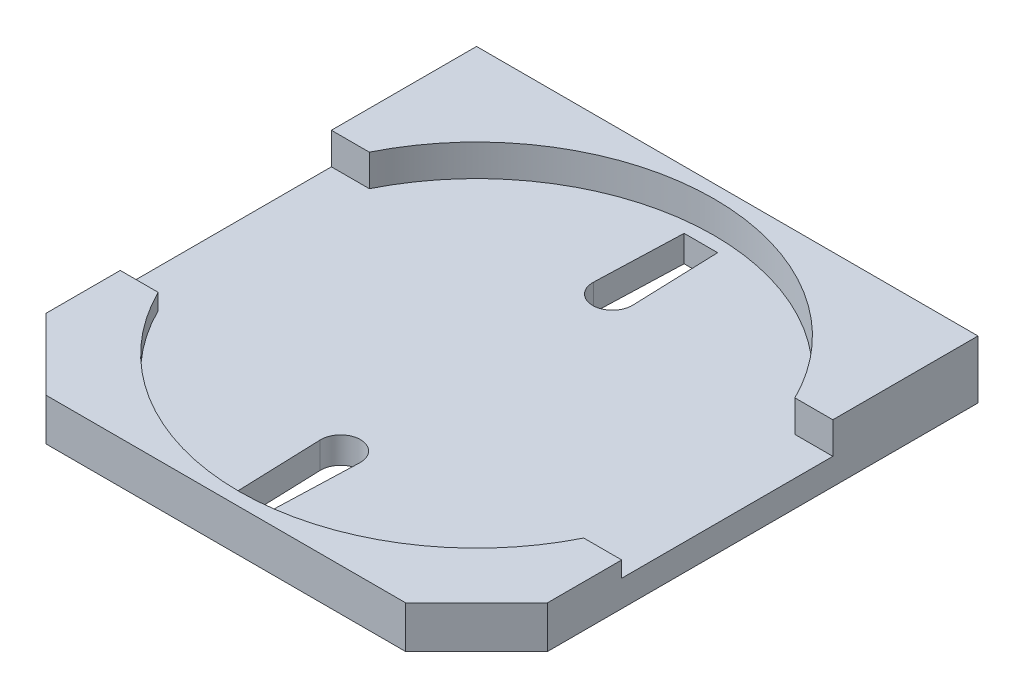
ISO-10303-21;
HEADER;
FILE_DESCRIPTION(('STEP AP214'),'2;1');
FILE_NAME('part.step','',(''),(''),'','','');
FILE_SCHEMA(('AUTOMOTIVE_DESIGN { 1 0 10303 214 1 1 1 1 }'));
ENDSEC;
DATA;
#1=APPLICATION_CONTEXT('core data for automotive mechanical design processes');
#2=APPLICATION_PROTOCOL_DEFINITION('international standard','automotive_design',2000,#1);
#3=PRODUCT_CONTEXT('',#1,'mechanical');
#4=PRODUCT('Part','Part','',(#3));
#5=PRODUCT_RELATED_PRODUCT_CATEGORY('part','',(#4));
#6=PRODUCT_DEFINITION_FORMATION('','',#4);
#7=PRODUCT_DEFINITION_CONTEXT('part definition',#1,'design');
#8=PRODUCT_DEFINITION('design','',#6,#7);
#9=PRODUCT_DEFINITION_SHAPE('','',#8);
#10=(LENGTH_UNIT() NAMED_UNIT(*) SI_UNIT(.MILLI.,.METRE.));
#11=(NAMED_UNIT(*) PLANE_ANGLE_UNIT() SI_UNIT($,.RADIAN.));
#12=(NAMED_UNIT(*) SI_UNIT($,.STERADIAN.) SOLID_ANGLE_UNIT());
#13=UNCERTAINTY_MEASURE_WITH_UNIT(LENGTH_MEASURE(1.E-05),#10,'distance_accuracy_value','');
#14=(GEOMETRIC_REPRESENTATION_CONTEXT(3) GLOBAL_UNCERTAINTY_ASSIGNED_CONTEXT((#13)) GLOBAL_UNIT_ASSIGNED_CONTEXT((#10,
#11,#12)) REPRESENTATION_CONTEXT('',''));
#15=CARTESIAN_POINT('',(0.,0.,0.));
#16=DIRECTION('',(0.,0.,1.));
#17=DIRECTION('',(1.,0.,0.));
#18=AXIS2_PLACEMENT_3D('',#15,#16,#17);
#19=CARTESIAN_POINT('',(-0.6,2.3,9.49999999999999));
#20=DIRECTION('',(0.999402445633192,0.,-0.0345651799126632));
#21=DIRECTION('',(-0.0345651799126632,0.,-0.999402445633192));
#22=AXIS2_PLACEMENT_3D('',#19,#20,#21);
#23=PLANE('',#22);
#24=DIRECTION('',(0.0345651799126632,0.,0.999402445633192));
#25=VECTOR('',#24,1.);
#26=CARTESIAN_POINT('',(-0.6,2.3,9.49999999999999));
#27=LINE('',#26,#25);
#28=CARTESIAN_POINT('',(-0.749551834224894,2.3,5.17592388493449));
#29=VERTEX_POINT('',#28);
#30=CARTESIAN_POINT('',(-0.63458584683647,2.3,8.49999999999999));
#31=VERTEX_POINT('',#30);
#32=EDGE_CURVE('E192',#29,#31,#27,.T.);
#33=ORIENTED_EDGE('',*,*,#32,.T.);
#34=DIRECTION('',(0.,-1.,0.));
#35=VECTOR('',#34,1.);
#36=CARTESIAN_POINT('',(-0.63458584683647,2.3,8.49999999999999));
#37=LINE('',#36,#35);
#38=CARTESIAN_POINT('',(-0.63458584683647,1.3,8.49999999999999));
#39=VERTEX_POINT('',#38);
#40=EDGE_CURVE('E196',#31,#39,#37,.T.);
#41=ORIENTED_EDGE('',*,*,#40,.T.);
#42=DIRECTION('',(0.0345651799126632,0.,0.999402445633192));
#43=VECTOR('',#42,1.);
#44=CARTESIAN_POINT('',(-0.6,1.3,9.49999999999999));
#45=LINE('',#44,#43);
#46=CARTESIAN_POINT('',(-0.749551834224894,1.3,5.17592388493449));
#47=VERTEX_POINT('',#46);
#48=EDGE_CURVE('E217',#47,#39,#45,.T.);
#49=ORIENTED_EDGE('',*,*,#48,.F.);
#50=DIRECTION('',(0.,-1.,0.));
#51=VECTOR('',#50,1.);
#52=CARTESIAN_POINT('',(-0.749551834224894,2.3,5.17592388493449));
#53=LINE('',#52,#51);
#54=EDGE_CURVE('E205',#29,#47,#53,.T.);
#55=ORIENTED_EDGE('',*,*,#54,.F.);
#56=EDGE_LOOP('',(#33,#41,#49,#55));
#57=FACE_BOUND('',#56,.T.);
#58=ADVANCED_FACE('F36',(#57),#23,.T.);
#59=CARTESIAN_POINT('',(0.6,2.3,9.49999999999999));
#60=DIRECTION('',(-0.999402445633192,0.,-0.0345651799126632));
#61=DIRECTION('',(-0.0345651799126632,0.,0.999402445633192));
#62=AXIS2_PLACEMENT_3D('',#59,#60,#61);
#63=PLANE('',#62);
#64=DIRECTION('',(0.0345651799126632,0.,-0.999402445633192));
#65=VECTOR('',#64,1.);
#66=CARTESIAN_POINT('',(0.6,1.3,9.49999999999999));
#67=LINE('',#66,#65);
#68=CARTESIAN_POINT('',(0.63458584683647,1.3,8.49999999999999));
#69=VERTEX_POINT('',#68);
#70=CARTESIAN_POINT('',(0.749551834224894,1.3,5.17592388493449));
#71=VERTEX_POINT('',#70);
#72=EDGE_CURVE('E207',#69,#71,#67,.T.);
#73=ORIENTED_EDGE('',*,*,#72,.F.);
#74=DIRECTION('',(0.,-1.,0.));
#75=VECTOR('',#74,1.);
#76=CARTESIAN_POINT('',(0.63458584683647,2.3,8.49999999999999));
#77=LINE('',#76,#75);
#78=CARTESIAN_POINT('',(0.63458584683647,2.3,8.49999999999999));
#79=VERTEX_POINT('',#78);
#80=EDGE_CURVE('E201',#79,#69,#77,.T.);
#81=ORIENTED_EDGE('',*,*,#80,.F.);
#82=DIRECTION('',(0.0345651799126632,0.,-0.999402445633192));
#83=VECTOR('',#82,1.);
#84=CARTESIAN_POINT('',(0.6,2.3,9.49999999999999));
#85=LINE('',#84,#83);
#86=CARTESIAN_POINT('',(0.749551834224894,2.3,5.17592388493449));
#87=VERTEX_POINT('',#86);
#88=EDGE_CURVE('E193',#79,#87,#85,.T.);
#89=ORIENTED_EDGE('',*,*,#88,.T.);
#90=DIRECTION('',(0.,-1.,0.));
#91=VECTOR('',#90,1.);
#92=CARTESIAN_POINT('',(0.749551834224894,2.3,5.17592388493449));
#93=LINE('',#92,#91);
#94=EDGE_CURVE('E221',#87,#71,#93,.T.);
#95=ORIENTED_EDGE('',*,*,#94,.T.);
#96=EDGE_LOOP('',(#73,#81,#89,#95));
#97=FACE_BOUND('',#96,.T.);
#98=ADVANCED_FACE('F437',(#97),#63,.T.);
#99=CARTESIAN_POINT('',(-9.5,3.5,9.5));
#100=DIRECTION('',(0.,0.,-1.));
#101=DIRECTION('',(-1.,0.,0.));
#102=AXIS2_PLACEMENT_3D('',#99,#100,#101);
#103=PLANE('',#102);
#104=DIRECTION('',(0.,1.,0.));
#105=VECTOR('',#104,1.);
#106=CARTESIAN_POINT('',(-6.81299423149112,0.,9.5));
#107=LINE('',#106,#105);
#108=CARTESIAN_POINT('',(-6.81299423149112,1.3,9.5));
#109=VERTEX_POINT('',#108);
#110=CARTESIAN_POINT('',(-6.81299423149112,2.9,9.5));
#111=VERTEX_POINT('',#110);
#112=EDGE_CURVE('E348',#109,#111,#107,.T.);
#113=ORIENTED_EDGE('',*,*,#112,.F.);
#114=DIRECTION('',(-1.,0.,0.));
#115=VECTOR('',#114,1.);
#116=CARTESIAN_POINT('',(-9.5,1.3,9.5));
#117=LINE('',#116,#115);
#118=CARTESIAN_POINT('',(6.81299423149112,1.3,9.5));
#119=VERTEX_POINT('',#118);
#120=EDGE_CURVE('E266',#119,#109,#117,.T.);
#121=ORIENTED_EDGE('',*,*,#120,.F.);
#122=DIRECTION('',(0.,1.,0.));
#123=VECTOR('',#122,1.);
#124=CARTESIAN_POINT('',(6.81299423149112,0.,9.5));
#125=LINE('',#124,#123);
#126=CARTESIAN_POINT('',(6.81299423149112,2.9,9.5));
#127=VERTEX_POINT('',#126);
#128=EDGE_CURVE('E346',#119,#127,#125,.T.);
#129=ORIENTED_EDGE('',*,*,#128,.T.);
#130=DIRECTION('',(1.,0.,0.));
#131=VECTOR('',#130,1.);
#132=CARTESIAN_POINT('',(6.81299423149112,2.9,9.5));
#133=LINE('',#132,#131);
#134=EDGE_CURVE('E329',#111,#127,#133,.T.);
#135=ORIENTED_EDGE('',*,*,#134,.F.);
#136=EDGE_LOOP('',(#113,#121,#129,#135));
#137=FACE_BOUND('',#136,.T.);
#138=ADVANCED_FACE('F384',(#137),#103,.F.);
#139=CARTESIAN_POINT('',(9.5,3.5,9.5));
#140=DIRECTION('',(-1.,0.,0.));
#141=DIRECTION('',(0.,0.,1.));
#142=AXIS2_PLACEMENT_3D('',#139,#140,#141);
#143=PLANE('',#142);
#144=DIRECTION('',(0.,0.,1.));
#145=VECTOR('',#144,1.);
#146=CARTESIAN_POINT('',(9.5,1.3,9.5));
#147=LINE('',#146,#145);
#148=CARTESIAN_POINT('',(9.5,1.3,-9.49999999999999));
#149=VERTEX_POINT('',#148);
#150=CARTESIAN_POINT('',(9.5,1.3,6.81299423149112));
#151=VERTEX_POINT('',#150);
#152=EDGE_CURVE('E270',#149,#151,#147,.T.);
#153=ORIENTED_EDGE('',*,*,#152,.F.);
#154=DIRECTION('',(0.,-1.,0.));
#155=VECTOR('',#154,1.);
#156=CARTESIAN_POINT('',(9.5,3.5,-9.5));
#157=LINE('',#156,#155);
#158=CARTESIAN_POINT('',(9.5,3.5,-9.5));
#159=VERTEX_POINT('',#158);
#160=EDGE_CURVE('E44',#159,#149,#157,.T.);
#161=ORIENTED_EDGE('',*,*,#160,.F.);
#162=DIRECTION('',(0.,0.,-1.));
#163=VECTOR('',#162,1.);
#164=CARTESIAN_POINT('',(9.5,3.5,9.5));
#165=LINE('',#164,#163);
#166=CARTESIAN_POINT('',(9.5,3.5,-4.));
#167=VERTEX_POINT('',#166);
#168=EDGE_CURVE('E352',#167,#159,#165,.T.);
#169=ORIENTED_EDGE('',*,*,#168,.F.);
#170=DIRECTION('',(0.,1.,0.));
#171=VECTOR('',#170,1.);
#172=CARTESIAN_POINT('',(9.5,2.9,-4.));
#173=LINE('',#172,#171);
#174=CARTESIAN_POINT('',(9.5,2.3,-4.));
#175=VERTEX_POINT('',#174);
#176=EDGE_CURVE('E338',#175,#167,#173,.T.);
#177=ORIENTED_EDGE('',*,*,#176,.F.);
#178=DIRECTION('',(0.,0.,-1.));
#179=VECTOR('',#178,1.);
#180=CARTESIAN_POINT('',(9.5,2.3,-4.));
#181=LINE('',#180,#179);
#182=CARTESIAN_POINT('',(9.5,2.3,4.));
#183=VERTEX_POINT('',#182);
#184=EDGE_CURVE('E307',#183,#175,#181,.T.);
#185=ORIENTED_EDGE('',*,*,#184,.F.);
#186=DIRECTION('',(0.,1.,0.));
#187=VECTOR('',#186,1.);
#188=CARTESIAN_POINT('',(9.5,2.3,4.));
#189=LINE('',#188,#187);
#190=CARTESIAN_POINT('',(9.5,2.9,4.));
#191=VERTEX_POINT('',#190);
#192=EDGE_CURVE('E317',#183,#191,#189,.T.);
#193=ORIENTED_EDGE('',*,*,#192,.T.);
#194=DIRECTION('',(0.,0.,-1.));
#195=VECTOR('',#194,1.);
#196=CARTESIAN_POINT('',(9.5,2.9,-4.));
#197=LINE('',#196,#195);
#198=CARTESIAN_POINT('',(9.5,2.9,6.81299423149112));
#199=VERTEX_POINT('',#198);
#200=EDGE_CURVE('E335',#199,#191,#197,.T.);
#201=ORIENTED_EDGE('',*,*,#200,.F.);
#202=DIRECTION('',(0.,1.,0.));
#203=VECTOR('',#202,1.);
#204=CARTESIAN_POINT('',(9.5,0.,6.81299423149112));
#205=LINE('',#204,#203);
#206=EDGE_CURVE('E344',#151,#199,#205,.T.);
#207=ORIENTED_EDGE('',*,*,#206,.F.);
#208=EDGE_LOOP('',(#153,#161,#169,#177,#185,#193,#201,#207));
#209=FACE_BOUND('',#208,.T.);
#210=ADVANCED_FACE('F38',(#209),#143,.F.);
#211=CARTESIAN_POINT('',(-9.5,3.5,-9.5));
#212=DIRECTION('',(0.,0.,1.));
#213=DIRECTION('',(1.,0.,0.));
#214=AXIS2_PLACEMENT_3D('',#211,#212,#213);
#215=PLANE('',#214);
#216=ORIENTED_EDGE('',*,*,#160,.T.);
#217=DIRECTION('',(1.,0.,0.));
#218=VECTOR('',#217,1.);
#219=CARTESIAN_POINT('',(-9.5,1.3,-9.5));
#220=LINE('',#219,#218);
#221=CARTESIAN_POINT('',(-9.5,1.3,-9.49999999999999));
#222=VERTEX_POINT('',#221);
#223=EDGE_CURVE('E276',#222,#149,#220,.T.);
#224=ORIENTED_EDGE('',*,*,#223,.F.);
#225=DIRECTION('',(0.,-1.,0.));
#226=VECTOR('',#225,1.);
#227=CARTESIAN_POINT('',(-9.5,3.5,-9.5));
#228=LINE('',#227,#226);
#229=CARTESIAN_POINT('',(-9.5,3.5,-9.5));
#230=VERTEX_POINT('',#229);
#231=EDGE_CURVE('E360',#230,#222,#228,.T.);
#232=ORIENTED_EDGE('',*,*,#231,.F.);
#233=DIRECTION('',(-1.,0.,0.));
#234=VECTOR('',#233,1.);
#235=CARTESIAN_POINT('',(-9.5,3.5,-9.5));
#236=LINE('',#235,#234);
#237=EDGE_CURVE('E355',#159,#230,#236,.T.);
#238=ORIENTED_EDGE('',*,*,#237,.F.);
#239=EDGE_LOOP('',(#216,#224,#232,#238));
#240=FACE_BOUND('',#239,.T.);
#241=ADVANCED_FACE('F367',(#240),#215,.F.);
#242=CARTESIAN_POINT('',(-9.5,3.5,9.5));
#243=DIRECTION('',(1.,0.,0.));
#244=DIRECTION('',(0.,0.,-1.));
#245=AXIS2_PLACEMENT_3D('',#242,#243,#244);
#246=PLANE('',#245);
#247=DIRECTION('',(0.,0.,-1.));
#248=VECTOR('',#247,1.);
#249=CARTESIAN_POINT('',(-9.5,1.3,9.5));
#250=LINE('',#249,#248);
#251=CARTESIAN_POINT('',(-9.5,1.3,6.81299423149112));
#252=VERTEX_POINT('',#251);
#253=EDGE_CURVE('E274',#252,#222,#250,.T.);
#254=ORIENTED_EDGE('',*,*,#253,.F.);
#255=DIRECTION('',(0.,1.,0.));
#256=VECTOR('',#255,1.);
#257=CARTESIAN_POINT('',(-9.5,0.,6.81299423149112));
#258=LINE('',#257,#256);
#259=CARTESIAN_POINT('',(-9.5,2.9,6.81299423149112));
#260=VERTEX_POINT('',#259);
#261=EDGE_CURVE('E350',#252,#260,#258,.T.);
#262=ORIENTED_EDGE('',*,*,#261,.T.);
#263=DIRECTION('',(0.,0.,1.));
#264=VECTOR('',#263,1.);
#265=CARTESIAN_POINT('',(-9.5,2.9,6.81299423149112));
#266=LINE('',#265,#264);
#267=CARTESIAN_POINT('',(-9.5,2.9,4.));
#268=VERTEX_POINT('',#267);
#269=EDGE_CURVE('E322',#268,#260,#266,.T.);
#270=ORIENTED_EDGE('',*,*,#269,.F.);
#271=DIRECTION('',(0.,1.,0.));
#272=VECTOR('',#271,1.);
#273=CARTESIAN_POINT('',(-9.5,2.3,4.));
#274=LINE('',#273,#272);
#275=CARTESIAN_POINT('',(-9.5,2.3,4.));
#276=VERTEX_POINT('',#275);
#277=EDGE_CURVE('E314',#276,#268,#274,.T.);
#278=ORIENTED_EDGE('',*,*,#277,.F.);
#279=DIRECTION('',(0.,0.,1.));
#280=VECTOR('',#279,1.);
#281=CARTESIAN_POINT('',(-9.5,2.3,-4.));
#282=LINE('',#281,#280);
#283=CARTESIAN_POINT('',(-9.5,2.3,-4.));
#284=VERTEX_POINT('',#283);
#285=EDGE_CURVE('E299',#284,#276,#282,.T.);
#286=ORIENTED_EDGE('',*,*,#285,.F.);
#287=DIRECTION('',(0.,1.,0.));
#288=VECTOR('',#287,1.);
#289=CARTESIAN_POINT('',(-9.5,2.9,-4.));
#290=LINE('',#289,#288);
#291=CARTESIAN_POINT('',(-9.5,3.5,-4.));
#292=VERTEX_POINT('',#291);
#293=EDGE_CURVE('E341',#284,#292,#290,.T.);
#294=ORIENTED_EDGE('',*,*,#293,.T.);
#295=DIRECTION('',(0.,0.,1.));
#296=VECTOR('',#295,1.);
#297=CARTESIAN_POINT('',(-9.5,3.5,9.5));
#298=LINE('',#297,#296);
#299=EDGE_CURVE('E357',#230,#292,#298,.T.);
#300=ORIENTED_EDGE('',*,*,#299,.F.);
#301=ORIENTED_EDGE('',*,*,#231,.T.);
#302=EDGE_LOOP('',(#254,#262,#270,#278,#286,#294,#300,#301));
#303=FACE_BOUND('',#302,.T.);
#304=ADVANCED_FACE('F397',(#303),#246,.F.);
#305=CARTESIAN_POINT('',(-9.5,0.,6.81299423149112));
#306=DIRECTION('',(0.707106781186548,0.,-0.707106781186548));
#307=DIRECTION('',(-0.707106781186548,0.,-0.707106781186548));
#308=AXIS2_PLACEMENT_3D('',#305,#306,#307);
#309=PLANE('',#308);
#310=DIRECTION('',(-0.707106781186548,0.,-0.707106781186548));
#311=VECTOR('',#310,1.);
#312=CARTESIAN_POINT('',(-9.5,1.3,6.81299423149112));
#313=LINE('',#312,#311);
#314=EDGE_CURVE('E272',#109,#252,#313,.T.);
#315=ORIENTED_EDGE('',*,*,#314,.F.);
#316=ORIENTED_EDGE('',*,*,#112,.T.);
#317=DIRECTION('',(0.707106781186547,0.,0.707106781186547));
#318=VECTOR('',#317,1.);
#319=CARTESIAN_POINT('',(-6.81299423149112,2.9,9.5));
#320=LINE('',#319,#318);
#321=EDGE_CURVE('E325',#260,#111,#320,.T.);
#322=ORIENTED_EDGE('',*,*,#321,.F.);
#323=ORIENTED_EDGE('',*,*,#261,.F.);
#324=EDGE_LOOP('',(#315,#316,#322,#323));
#325=FACE_BOUND('',#324,.T.);
#326=ADVANCED_FACE('F394',(#325),#309,.F.);
#327=CARTESIAN_POINT('',(9.5,0.,6.81299423149112));
#328=DIRECTION('',(0.707106781186548,0.,0.707106781186548));
#329=DIRECTION('',(0.707106781186548,0.,-0.707106781186548));
#330=AXIS2_PLACEMENT_3D('',#327,#328,#329);
#331=PLANE('',#330);
#332=ORIENTED_EDGE('',*,*,#128,.F.);
#333=DIRECTION('',(0.707106781186548,0.,-0.707106781186548));
#334=VECTOR('',#333,1.);
#335=CARTESIAN_POINT('',(9.5,1.3,6.81299423149112));
#336=LINE('',#335,#334);
#337=EDGE_CURVE('E12',#119,#151,#336,.T.);
#338=ORIENTED_EDGE('',*,*,#337,.T.);
#339=ORIENTED_EDGE('',*,*,#206,.T.);
#340=DIRECTION('',(0.707106781186547,0.,-0.707106781186547));
#341=VECTOR('',#340,1.);
#342=CARTESIAN_POINT('',(9.5,2.9,6.81299423149112));
#343=LINE('',#342,#341);
#344=EDGE_CURVE('E332',#127,#199,#343,.T.);
#345=ORIENTED_EDGE('',*,*,#344,.F.);
#346=EDGE_LOOP('',(#332,#338,#339,#345));
#347=FACE_BOUND('',#346,.T.);
#348=ADVANCED_FACE('F379',(#347),#331,.T.);
#349=CARTESIAN_POINT('',(-9.5,2.9,-4.));
#350=DIRECTION('',(0.,0.,-1.));
#351=DIRECTION('',(-1.,0.,0.));
#352=AXIS2_PLACEMENT_3D('',#349,#350,#351);
#353=PLANE('',#352);
#354=DIRECTION('',(-1.,0.,0.));
#355=VECTOR('',#354,1.);
#356=CARTESIAN_POINT('',(-9.5,2.3,-4.));
#357=LINE('',#356,#355);
#358=CARTESIAN_POINT('',(-8.06225774829855,2.3,-4.));
#359=VERTEX_POINT('',#358);
#360=EDGE_CURVE('E310',#359,#284,#357,.T.);
#361=ORIENTED_EDGE('',*,*,#360,.F.);
#362=DIRECTION('',(0.,1.,0.));
#363=VECTOR('',#362,1.);
#364=CARTESIAN_POINT('',(-8.06225774829855,2.3,-4.));
#365=LINE('',#364,#363);
#366=CARTESIAN_POINT('',(-8.06225774829855,3.5,-4.));
#367=VERTEX_POINT('',#366);
#368=EDGE_CURVE('E295',#359,#367,#365,.T.);
#369=ORIENTED_EDGE('',*,*,#368,.T.);
#370=DIRECTION('',(-1.,0.,0.));
#371=VECTOR('',#370,1.);
#372=CARTESIAN_POINT('',(-9.5,3.5,-4.));
#373=LINE('',#372,#371);
#374=EDGE_CURVE('E320',#367,#292,#373,.T.);
#375=ORIENTED_EDGE('',*,*,#374,.T.);
#376=ORIENTED_EDGE('',*,*,#293,.F.);
#377=EDGE_LOOP('',(#361,#369,#375,#376));
#378=FACE_BOUND('',#377,.T.);
#379=ADVANCED_FACE('F423',(#378),#353,.F.);
#380=CARTESIAN_POINT('',(-9.5,2.3,4.));
#381=DIRECTION('',(0.,0.,1.));
#382=DIRECTION('',(1.,0.,0.));
#383=AXIS2_PLACEMENT_3D('',#380,#381,#382);
#384=PLANE('',#383);
#385=DIRECTION('',(1.,0.,0.));
#386=VECTOR('',#385,1.);
#387=CARTESIAN_POINT('',(-9.5,2.3,4.));
#388=LINE('',#387,#386);
#389=CARTESIAN_POINT('',(8.06225774829855,2.3,4.));
#390=VERTEX_POINT('',#389);
#391=EDGE_CURVE('E302',#390,#183,#388,.T.);
#392=ORIENTED_EDGE('',*,*,#391,.F.);
#393=DIRECTION('',(0.,1.,0.));
#394=VECTOR('',#393,1.);
#395=CARTESIAN_POINT('',(8.06225774829855,2.3,4.));
#396=LINE('',#395,#394);
#397=CARTESIAN_POINT('',(8.06225774829855,2.9,4.));
#398=VERTEX_POINT('',#397);
#399=EDGE_CURVE('E289',#390,#398,#396,.T.);
#400=ORIENTED_EDGE('',*,*,#399,.T.);
#401=DIRECTION('',(1.,0.,0.));
#402=VECTOR('',#401,1.);
#403=CARTESIAN_POINT('',(-9.5,2.9,4.));
#404=LINE('',#403,#402);
#405=EDGE_CURVE('E298',#398,#191,#404,.T.);
#406=ORIENTED_EDGE('',*,*,#405,.T.);
#407=ORIENTED_EDGE('',*,*,#192,.F.);
#408=EDGE_LOOP('',(#392,#400,#406,#407));
#409=FACE_BOUND('',#408,.T.);
#410=ADVANCED_FACE('F415',(#409),#384,.F.);
#411=CARTESIAN_POINT('',(0.,3.5,0.));
#412=DIRECTION('',(0.,-1.,0.));
#413=DIRECTION('',(0.,0.,-1.));
#414=AXIS2_PLACEMENT_3D('',#411,#412,#413);
#415=PLANE('',#414);
#416=ORIENTED_EDGE('',*,*,#374,.F.);
#417=CARTESIAN_POINT('',(0.,3.5,0.));
#418=DIRECTION('',(0.,1.,0.));
#419=DIRECTION('',(0.,0.,1.));
#420=AXIS2_PLACEMENT_3D('',#417,#418,#419);
#421=CIRCLE('',#420,9.);
#422=CARTESIAN_POINT('',(8.06225774829855,3.5,-4.));
#423=VERTEX_POINT('',#422);
#424=EDGE_CURVE('E278',#423,#367,#421,.T.);
#425=ORIENTED_EDGE('',*,*,#424,.F.);
#426=EDGE_CURVE('E326',#167,#423,#373,.T.);
#427=ORIENTED_EDGE('',*,*,#426,.F.);
#428=ORIENTED_EDGE('',*,*,#168,.T.);
#429=ORIENTED_EDGE('',*,*,#237,.T.);
#430=ORIENTED_EDGE('',*,*,#299,.T.);
#431=EDGE_LOOP('',(#416,#425,#427,#428,#429,#430));
#432=FACE_BOUND('',#431,.T.);
#433=ADVANCED_FACE('F403',(#432),#415,.F.);
#434=ORIENTED_EDGE('',*,*,#426,.T.);
#435=DIRECTION('',(0.,1.,0.));
#436=VECTOR('',#435,1.);
#437=CARTESIAN_POINT('',(8.06225774829855,2.3,-4.));
#438=LINE('',#437,#436);
#439=CARTESIAN_POINT('',(8.06225774829855,2.3,-4.));
#440=VERTEX_POINT('',#439);
#441=EDGE_CURVE('E292',#423,#440,#438,.F.);
#442=ORIENTED_EDGE('',*,*,#441,.T.);
#443=EDGE_CURVE('E311',#175,#440,#357,.T.);
#444=ORIENTED_EDGE('',*,*,#443,.F.);
#445=ORIENTED_EDGE('',*,*,#176,.T.);
#446=EDGE_LOOP('',(#434,#442,#444,#445));
#447=FACE_BOUND('',#446,.T.);
#448=ADVANCED_FACE('F407',(#447),#353,.F.);
#449=CARTESIAN_POINT('',(0.,2.9,0.));
#450=DIRECTION('',(0.,-1.,0.));
#451=DIRECTION('',(0.,0.,-1.));
#452=AXIS2_PLACEMENT_3D('',#449,#450,#451);
#453=PLANE('',#452);
#454=ORIENTED_EDGE('',*,*,#405,.F.);
#455=CARTESIAN_POINT('',(0.,2.9,0.));
#456=DIRECTION('',(0.,-1.,0.));
#457=DIRECTION('',(0.,0.,-1.));
#458=AXIS2_PLACEMENT_3D('',#455,#456,#457);
#459=CIRCLE('',#458,9.);
#460=CARTESIAN_POINT('',(-8.06225774829855,2.9,4.));
#461=VERTEX_POINT('',#460);
#462=EDGE_CURVE('E286',#398,#461,#459,.T.);
#463=ORIENTED_EDGE('',*,*,#462,.T.);
#464=EDGE_CURVE('E303',#268,#461,#404,.T.);
#465=ORIENTED_EDGE('',*,*,#464,.F.);
#466=ORIENTED_EDGE('',*,*,#269,.T.);
#467=ORIENTED_EDGE('',*,*,#321,.T.);
#468=ORIENTED_EDGE('',*,*,#134,.T.);
#469=ORIENTED_EDGE('',*,*,#344,.T.);
#470=ORIENTED_EDGE('',*,*,#200,.T.);
#471=EDGE_LOOP('',(#454,#463,#465,#466,#467,#468,#469,#470));
#472=FACE_BOUND('',#471,.T.);
#473=ADVANCED_FACE('F387',(#472),#453,.F.);
#474=ORIENTED_EDGE('',*,*,#464,.T.);
#475=DIRECTION('',(0.,1.,0.));
#476=VECTOR('',#475,1.);
#477=CARTESIAN_POINT('',(-8.06225774829855,2.3,4.));
#478=LINE('',#477,#476);
#479=CARTESIAN_POINT('',(-8.06225774829855,2.3,4.));
#480=VERTEX_POINT('',#479);
#481=EDGE_CURVE('E283',#461,#480,#478,.F.);
#482=ORIENTED_EDGE('',*,*,#481,.T.);
#483=EDGE_CURVE('E304',#276,#480,#388,.T.);
#484=ORIENTED_EDGE('',*,*,#483,.F.);
#485=ORIENTED_EDGE('',*,*,#277,.T.);
#486=EDGE_LOOP('',(#474,#482,#484,#485));
#487=FACE_BOUND('',#486,.T.);
#488=ADVANCED_FACE('F418',(#487),#384,.F.);
#489=CARTESIAN_POINT('',(0.,2.3,0.));
#490=DIRECTION('',(0.,1.,0.));
#491=DIRECTION('',(0.,0.,1.));
#492=AXIS2_PLACEMENT_3D('',#489,#490,#491);
#493=PLANE('',#492);
#494=CARTESIAN_POINT('',(0.,2.3,0.));
#495=DIRECTION('',(0.,1.,0.));
#496=DIRECTION('',(0.,0.,1.));
#497=AXIS2_PLACEMENT_3D('',#494,#495,#496);
#498=CIRCLE('',#497,9.);
#499=EDGE_CURVE('E279',#480,#390,#498,.T.);
#500=ORIENTED_EDGE('',*,*,#499,.T.);
#501=ORIENTED_EDGE('',*,*,#391,.T.);
#502=ORIENTED_EDGE('',*,*,#184,.T.);
#503=ORIENTED_EDGE('',*,*,#443,.T.);
#504=EDGE_CURVE('E281',#440,#359,#498,.T.);
#505=ORIENTED_EDGE('',*,*,#504,.T.);
#506=ORIENTED_EDGE('',*,*,#360,.T.);
#507=ORIENTED_EDGE('',*,*,#285,.T.);
#508=ORIENTED_EDGE('',*,*,#483,.T.);
#509=EDGE_LOOP('',(#500,#501,#502,#503,#505,#506,#507,#508));
#510=FACE_BOUND('',#509,.T.);
#511=DIRECTION('',(-1.,0.,0.));
#512=VECTOR('',#511,1.);
#513=CARTESIAN_POINT('',(0.63458584683647,2.3,8.49999999999999));
#514=LINE('',#513,#512);
#515=EDGE_CURVE('E186',#79,#31,#514,.T.);
#516=ORIENTED_EDGE('',*,*,#515,.T.);
#517=ORIENTED_EDGE('',*,*,#32,.F.);
#518=CARTESIAN_POINT('',(0.,2.3,5.15));
#519=DIRECTION('',(0.,1.,0.));
#520=DIRECTION('',(0.,0.,1.));
#521=AXIS2_PLACEMENT_3D('',#518,#519,#520);
#522=CIRCLE('',#521,0.75);
#523=EDGE_CURVE('E206',#87,#29,#522,.T.);
#524=ORIENTED_EDGE('',*,*,#523,.F.);
#525=ORIENTED_EDGE('',*,*,#88,.F.);
#526=EDGE_LOOP('',(#516,#517,#524,#525));
#527=FACE_BOUND('',#526,.T.);
#528=DIRECTION('',(0.0345651799126632,0.,-0.999402445633192));
#529=VECTOR('',#528,1.);
#530=CARTESIAN_POINT('',(-0.6,2.3,-9.49999999999999));
#531=LINE('',#530,#529);
#532=CARTESIAN_POINT('',(-0.749551834224894,2.3,-5.17592388493449));
#533=VERTEX_POINT('',#532);
#534=CARTESIAN_POINT('',(-0.63458584683647,2.3,-8.49999999999999));
#535=VERTEX_POINT('',#534);
#536=EDGE_CURVE('E226',#533,#535,#531,.T.);
#537=ORIENTED_EDGE('',*,*,#536,.T.);
#538=DIRECTION('',(-1.,0.,0.));
#539=VECTOR('',#538,1.);
#540=CARTESIAN_POINT('',(0.63458584683647,2.3,-8.49999999999999));
#541=LINE('',#540,#539);
#542=CARTESIAN_POINT('',(0.63458584683647,2.3,-8.49999999999999));
#543=VERTEX_POINT('',#542);
#544=EDGE_CURVE('E745',#543,#535,#541,.T.);
#545=ORIENTED_EDGE('',*,*,#544,.F.);
#546=DIRECTION('',(0.0345651799126632,0.,0.999402445633192));
#547=VECTOR('',#546,1.);
#548=CARTESIAN_POINT('',(0.6,2.3,-9.49999999999999));
#549=LINE('',#548,#547);
#550=CARTESIAN_POINT('',(0.749551834224894,2.3,-5.17592388493449));
#551=VERTEX_POINT('',#550);
#552=EDGE_CURVE('E228',#543,#551,#549,.T.);
#553=ORIENTED_EDGE('',*,*,#552,.T.);
#554=CARTESIAN_POINT('',(0.,2.3,-5.15));
#555=DIRECTION('',(0.,-1.,0.));
#556=DIRECTION('',(0.,0.,-1.));
#557=AXIS2_PLACEMENT_3D('',#554,#555,#556);
#558=CIRCLE('',#557,0.75);
#559=EDGE_CURVE('E231',#551,#533,#558,.T.);
#560=ORIENTED_EDGE('',*,*,#559,.T.);
#561=EDGE_LOOP('',(#537,#545,#553,#560));
#562=FACE_BOUND('',#561,.T.);
#563=ADVANCED_FACE('F188',(#510,#527,#562),#493,.T.);
#564=CARTESIAN_POINT('',(0.,2.3,0.));
#565=DIRECTION('',(0.,1.,0.));
#566=DIRECTION('',(0.,0.,1.));
#567=AXIS2_PLACEMENT_3D('',#564,#565,#566);
#568=CYLINDRICAL_SURFACE('',#567,9.);
#569=ORIENTED_EDGE('',*,*,#499,.F.);
#570=ORIENTED_EDGE('',*,*,#481,.F.);
#571=ORIENTED_EDGE('',*,*,#462,.F.);
#572=ORIENTED_EDGE('',*,*,#399,.F.);
#573=EDGE_LOOP('',(#569,#570,#571,#572));
#574=FACE_BOUND('',#573,.T.);
#575=ADVANCED_FACE('F427',(#574),#568,.F.);
#576=ORIENTED_EDGE('',*,*,#504,.F.);
#577=ORIENTED_EDGE('',*,*,#441,.F.);
#578=ORIENTED_EDGE('',*,*,#424,.T.);
#579=ORIENTED_EDGE('',*,*,#368,.F.);
#580=EDGE_LOOP('',(#576,#577,#578,#579));
#581=FACE_BOUND('',#580,.T.);
#582=ADVANCED_FACE('F425',(#581),#568,.F.);
#583=CARTESIAN_POINT('',(0.,1.3,0.));
#584=DIRECTION('',(0.,-1.,0.));
#585=DIRECTION('',(0.,0.,-1.));
#586=AXIS2_PLACEMENT_3D('',#583,#584,#585);
#587=PLANE('',#586);
#588=ORIENTED_EDGE('',*,*,#120,.T.);
#589=ORIENTED_EDGE('',*,*,#314,.T.);
#590=ORIENTED_EDGE('',*,*,#253,.T.);
#591=ORIENTED_EDGE('',*,*,#223,.T.);
#592=ORIENTED_EDGE('',*,*,#152,.T.);
#593=ORIENTED_EDGE('',*,*,#337,.F.);
#594=EDGE_LOOP('',(#588,#589,#590,#591,#592,#593));
#595=FACE_BOUND('',#594,.T.);
#596=ORIENTED_EDGE('',*,*,#48,.T.);
#597=DIRECTION('',(-1.,0.,0.));
#598=VECTOR('',#597,1.);
#599=CARTESIAN_POINT('',(0.63458584683647,1.3,8.49999999999999));
#600=LINE('',#599,#598);
#601=EDGE_CURVE('E51',#69,#39,#600,.T.);
#602=ORIENTED_EDGE('',*,*,#601,.F.);
#603=ORIENTED_EDGE('',*,*,#72,.T.);
#604=CARTESIAN_POINT('',(0.,1.3,5.15));
#605=DIRECTION('',(0.,1.,0.));
#606=DIRECTION('',(0.,0.,1.));
#607=AXIS2_PLACEMENT_3D('',#604,#605,#606);
#608=CIRCLE('',#607,0.75);
#609=EDGE_CURVE('E210',#71,#47,#608,.T.);
#610=ORIENTED_EDGE('',*,*,#609,.T.);
#611=EDGE_LOOP('',(#596,#602,#603,#610));
#612=FACE_BOUND('',#611,.T.);
#613=DIRECTION('',(-1.,0.,0.));
#614=VECTOR('',#613,1.);
#615=CARTESIAN_POINT('',(0.63458584683647,1.3,-8.49999999999999));
#616=LINE('',#615,#614);
#617=CARTESIAN_POINT('',(0.63458584683647,1.3,-8.49999999999999));
#618=VERTEX_POINT('',#617);
#619=CARTESIAN_POINT('',(-0.63458584683647,1.3,-8.49999999999999));
#620=VERTEX_POINT('',#619);
#621=EDGE_CURVE('E739',#618,#620,#616,.T.);
#622=ORIENTED_EDGE('',*,*,#621,.T.);
#623=DIRECTION('',(0.0345651799126632,0.,-0.999402445633192));
#624=VECTOR('',#623,1.);
#625=CARTESIAN_POINT('',(-0.6,1.3,-9.49999999999999));
#626=LINE('',#625,#624);
#627=CARTESIAN_POINT('',(-0.749551834224894,1.3,-5.17592388493449));
#628=VERTEX_POINT('',#627);
#629=EDGE_CURVE('E224',#628,#620,#626,.T.);
#630=ORIENTED_EDGE('',*,*,#629,.F.);
#631=CARTESIAN_POINT('',(0.,1.3,-5.15));
#632=DIRECTION('',(0.,-1.,0.));
#633=DIRECTION('',(0.,0.,-1.));
#634=AXIS2_PLACEMENT_3D('',#631,#632,#633);
#635=CIRCLE('',#634,0.75);
#636=CARTESIAN_POINT('',(0.749551834224894,1.3,-5.17592388493449));
#637=VERTEX_POINT('',#636);
#638=EDGE_CURVE('E229',#637,#628,#635,.T.);
#639=ORIENTED_EDGE('',*,*,#638,.F.);
#640=DIRECTION('',(0.0345651799126632,0.,0.999402445633192));
#641=VECTOR('',#640,1.);
#642=CARTESIAN_POINT('',(0.6,1.3,-9.49999999999999));
#643=LINE('',#642,#641);
#644=EDGE_CURVE('E236',#618,#637,#643,.T.);
#645=ORIENTED_EDGE('',*,*,#644,.F.);
#646=EDGE_LOOP('',(#622,#630,#639,#645));
#647=FACE_BOUND('',#646,.T.);
#648=CARTESIAN_POINT('',(-5.5,1.3,-6.20094746980726));
#649=DIRECTION('',(0.,-1.,0.));
#650=DIRECTION('',(0.,0.,-1.));
#651=AXIS2_PLACEMENT_3D('',#648,#649,#650);
#652=CIRCLE('',#651,1.25);
#653=CARTESIAN_POINT('',(-5.5,1.3,-7.45094746980726));
#654=VERTEX_POINT('',#653);
#655=EDGE_CURVE('E263',#654,#654,#652,.T.);
#656=ORIENTED_EDGE('',*,*,#655,.F.);
#657=EDGE_LOOP('',(#656));
#658=FACE_BOUND('',#657,.T.);
#659=CARTESIAN_POINT('',(-5.5,1.3,5.29905253019274));
#660=DIRECTION('',(0.,-1.,0.));
#661=DIRECTION('',(0.,0.,-1.));
#662=AXIS2_PLACEMENT_3D('',#659,#660,#661);
#663=CIRCLE('',#662,1.25);
#664=CARTESIAN_POINT('',(-5.5,1.3,4.04905253019274));
#665=VERTEX_POINT('',#664);
#666=EDGE_CURVE('E257',#665,#665,#663,.T.);
#667=ORIENTED_EDGE('',*,*,#666,.F.);
#668=EDGE_LOOP('',(#667));
#669=FACE_BOUND('',#668,.T.);
#670=CARTESIAN_POINT('',(5.5,1.3,5.29905253019274));
#671=DIRECTION('',(0.,-1.,0.));
#672=DIRECTION('',(0.,0.,1.));
#673=AXIS2_PLACEMENT_3D('',#670,#671,#672);
#674=CIRCLE('',#673,1.25);
#675=CARTESIAN_POINT('',(5.5,1.3,6.54905253019274));
#676=VERTEX_POINT('',#675);
#677=EDGE_CURVE('E251',#676,#676,#674,.T.);
#678=ORIENTED_EDGE('',*,*,#677,.F.);
#679=EDGE_LOOP('',(#678));
#680=FACE_BOUND('',#679,.T.);
#681=CARTESIAN_POINT('',(5.5,1.3,-6.20094746980726));
#682=DIRECTION('',(0.,-1.,0.));
#683=DIRECTION('',(0.,0.,1.));
#684=AXIS2_PLACEMENT_3D('',#681,#682,#683);
#685=CIRCLE('',#684,1.25);
#686=CARTESIAN_POINT('',(5.5,1.3,-4.95094746980726));
#687=VERTEX_POINT('',#686);
#688=EDGE_CURVE('E245',#687,#687,#685,.T.);
#689=ORIENTED_EDGE('',*,*,#688,.F.);
#690=EDGE_LOOP('',(#689));
#691=FACE_BOUND('',#690,.T.);
#692=ADVANCED_FACE('F375',(#595,#612,#647,#658,#669,#680,#691),#587,.T.);
#693=CARTESIAN_POINT('',(-5.5,1.3,-6.20094746980726));
#694=DIRECTION('',(0.,-1.,0.));
#695=DIRECTION('',(0.,0.,-1.));
#696=AXIS2_PLACEMENT_3D('',#693,#694,#695);
#697=CYLINDRICAL_SURFACE('',#696,1.25);
#698=ORIENTED_EDGE('',*,*,#655,.T.);
#699=EDGE_LOOP('',(#698));
#700=FACE_BOUND('',#699,.T.);
#701=CARTESIAN_POINT('',(-5.5,0.,-6.20094746980726));
#702=DIRECTION('',(0.,-1.,0.));
#703=DIRECTION('',(0.,0.,-1.));
#704=AXIS2_PLACEMENT_3D('',#701,#702,#703);
#705=CIRCLE('',#704,1.25);
#706=CARTESIAN_POINT('',(-5.5,0.,-7.45094746980726));
#707=VERTEX_POINT('',#706);
#708=EDGE_CURVE('E260',#707,#707,#705,.T.);
#709=ORIENTED_EDGE('',*,*,#708,.F.);
#710=EDGE_LOOP('',(#709));
#711=FACE_BOUND('',#710,.T.);
#712=ADVANCED_FACE('F433',(#700,#711),#697,.T.);
#713=CARTESIAN_POINT('',(-5.5,1.3,5.29905253019274));
#714=DIRECTION('',(0.,-1.,0.));
#715=DIRECTION('',(0.,0.,-1.));
#716=AXIS2_PLACEMENT_3D('',#713,#714,#715);
#717=CYLINDRICAL_SURFACE('',#716,1.25);
#718=ORIENTED_EDGE('',*,*,#666,.T.);
#719=EDGE_LOOP('',(#718));
#720=FACE_BOUND('',#719,.T.);
#721=CARTESIAN_POINT('',(-5.5,0.,5.29905253019274));
#722=DIRECTION('',(0.,-1.,0.));
#723=DIRECTION('',(0.,0.,-1.));
#724=AXIS2_PLACEMENT_3D('',#721,#722,#723);
#725=CIRCLE('',#724,1.25);
#726=CARTESIAN_POINT('',(-5.5,0.,4.04905253019274));
#727=VERTEX_POINT('',#726);
#728=EDGE_CURVE('E254',#727,#727,#725,.T.);
#729=ORIENTED_EDGE('',*,*,#728,.F.);
#730=EDGE_LOOP('',(#729));
#731=FACE_BOUND('',#730,.T.);
#732=ADVANCED_FACE('F467',(#720,#731),#717,.T.);
#733=CARTESIAN_POINT('',(5.5,1.3,5.29905253019274));
#734=DIRECTION('',(0.,-1.,0.));
#735=DIRECTION('',(0.,0.,-1.));
#736=AXIS2_PLACEMENT_3D('',#733,#734,#735);
#737=CYLINDRICAL_SURFACE('',#736,1.25);
#738=ORIENTED_EDGE('',*,*,#677,.T.);
#739=EDGE_LOOP('',(#738));
#740=FACE_BOUND('',#739,.T.);
#741=CARTESIAN_POINT('',(5.5,0.,5.29905253019274));
#742=DIRECTION('',(0.,-1.,0.));
#743=DIRECTION('',(0.,0.,1.));
#744=AXIS2_PLACEMENT_3D('',#741,#742,#743);
#745=CIRCLE('',#744,1.25);
#746=CARTESIAN_POINT('',(5.5,0.,6.54905253019274));
#747=VERTEX_POINT('',#746);
#748=EDGE_CURVE('E248',#747,#747,#745,.T.);
#749=ORIENTED_EDGE('',*,*,#748,.F.);
#750=EDGE_LOOP('',(#749));
#751=FACE_BOUND('',#750,.T.);
#752=ADVANCED_FACE('F463',(#740,#751),#737,.T.);
#753=CARTESIAN_POINT('',(5.5,1.3,-6.20094746980726));
#754=DIRECTION('',(0.,-1.,0.));
#755=DIRECTION('',(0.,0.,-1.));
#756=AXIS2_PLACEMENT_3D('',#753,#754,#755);
#757=CYLINDRICAL_SURFACE('',#756,1.25);
#758=ORIENTED_EDGE('',*,*,#688,.T.);
#759=EDGE_LOOP('',(#758));
#760=FACE_BOUND('',#759,.T.);
#761=CARTESIAN_POINT('',(5.5,0.,-6.20094746980726));
#762=DIRECTION('',(0.,-1.,0.));
#763=DIRECTION('',(0.,0.,1.));
#764=AXIS2_PLACEMENT_3D('',#761,#762,#763);
#765=CIRCLE('',#764,1.25);
#766=CARTESIAN_POINT('',(5.5,0.,-4.95094746980726));
#767=VERTEX_POINT('',#766);
#768=EDGE_CURVE('E242',#767,#767,#765,.T.);
#769=ORIENTED_EDGE('',*,*,#768,.F.);
#770=EDGE_LOOP('',(#769));
#771=FACE_BOUND('',#770,.T.);
#772=ADVANCED_FACE('F459',(#760,#771),#757,.T.);
#773=CARTESIAN_POINT('',(0.,0.,0.));
#774=DIRECTION('',(0.,-1.,0.));
#775=DIRECTION('',(0.,0.,-1.));
#776=AXIS2_PLACEMENT_3D('',#773,#774,#775);
#777=PLANE('',#776);
#778=ORIENTED_EDGE('',*,*,#768,.T.);
#779=EDGE_LOOP('',(#778));
#780=FACE_BOUND('',#779,.T.);
#781=ADVANCED_FACE('F462',(#780),#777,.T.);
#782=ORIENTED_EDGE('',*,*,#748,.T.);
#783=EDGE_LOOP('',(#782));
#784=FACE_BOUND('',#783,.T.);
#785=ADVANCED_FACE('F486',(#784),#777,.T.);
#786=ORIENTED_EDGE('',*,*,#728,.T.);
#787=EDGE_LOOP('',(#786));
#788=FACE_BOUND('',#787,.T.);
#789=ADVANCED_FACE('F481',(#788),#777,.T.);
#790=ORIENTED_EDGE('',*,*,#708,.T.);
#791=EDGE_LOOP('',(#790));
#792=FACE_BOUND('',#791,.T.);
#793=ADVANCED_FACE('F458',(#792),#777,.T.);
#794=CARTESIAN_POINT('',(-0.6,2.3,-9.49999999999999));
#795=DIRECTION('',(-0.999402445633192,0.,-0.0345651799126632));
#796=DIRECTION('',(-0.0345651799126632,0.,0.999402445633192));
#797=AXIS2_PLACEMENT_3D('',#794,#795,#796);
#798=PLANE('',#797);
#799=ORIENTED_EDGE('',*,*,#629,.T.);
#800=DIRECTION('',(0.,-1.,0.));
#801=VECTOR('',#800,1.);
#802=CARTESIAN_POINT('',(-0.63458584683647,2.3,-8.49999999999999));
#803=LINE('',#802,#801);
#804=EDGE_CURVE('E59',#535,#620,#803,.T.);
#805=ORIENTED_EDGE('',*,*,#804,.F.);
#806=ORIENTED_EDGE('',*,*,#536,.F.);
#807=DIRECTION('',(0.,-1.,0.));
#808=VECTOR('',#807,1.);
#809=CARTESIAN_POINT('',(-0.749551834224894,2.3,-5.17592388493449));
#810=LINE('',#809,#808);
#811=EDGE_CURVE('E240',#533,#628,#810,.T.);
#812=ORIENTED_EDGE('',*,*,#811,.T.);
#813=EDGE_LOOP('',(#799,#805,#806,#812));
#814=FACE_BOUND('',#813,.T.);
#815=ADVANCED_FACE('F451',(#814),#798,.F.);
#816=CARTESIAN_POINT('',(0.,2.3,-5.15));
#817=DIRECTION('',(0.,-1.,0.));
#818=DIRECTION('',(0.,0.,-1.));
#819=AXIS2_PLACEMENT_3D('',#816,#817,#818);
#820=CYLINDRICAL_SURFACE('',#819,0.75);
#821=ORIENTED_EDGE('',*,*,#638,.T.);
#822=ORIENTED_EDGE('',*,*,#811,.F.);
#823=ORIENTED_EDGE('',*,*,#559,.F.);
#824=DIRECTION('',(0.,-1.,0.));
#825=VECTOR('',#824,1.);
#826=CARTESIAN_POINT('',(0.749551834224894,2.3,-5.17592388493449));
#827=LINE('',#826,#825);
#828=EDGE_CURVE('E234',#551,#637,#827,.T.);
#829=ORIENTED_EDGE('',*,*,#828,.T.);
#830=EDGE_LOOP('',(#821,#822,#823,#829));
#831=FACE_BOUND('',#830,.T.);
#832=ADVANCED_FACE('F447',(#831),#820,.F.);
#833=CARTESIAN_POINT('',(0.6,2.3,-9.49999999999999));
#834=DIRECTION('',(0.999402445633192,0.,-0.0345651799126632));
#835=DIRECTION('',(-0.0345651799126632,0.,-0.999402445633192));
#836=AXIS2_PLACEMENT_3D('',#833,#834,#835);
#837=PLANE('',#836);
#838=ORIENTED_EDGE('',*,*,#552,.F.);
#839=DIRECTION('',(0.,-1.,0.));
#840=VECTOR('',#839,1.);
#841=CARTESIAN_POINT('',(0.63458584683647,2.3,-8.49999999999999));
#842=LINE('',#841,#840);
#843=EDGE_CURVE('E213',#543,#618,#842,.T.);
#844=ORIENTED_EDGE('',*,*,#843,.T.);
#845=ORIENTED_EDGE('',*,*,#644,.T.);
#846=ORIENTED_EDGE('',*,*,#828,.F.);
#847=EDGE_LOOP('',(#838,#844,#845,#846));
#848=FACE_BOUND('',#847,.T.);
#849=ADVANCED_FACE('F450',(#848),#837,.F.);
#850=CARTESIAN_POINT('',(0.,2.3,5.15));
#851=DIRECTION('',(0.,-1.,0.));
#852=DIRECTION('',(0.,0.,-1.));
#853=AXIS2_PLACEMENT_3D('',#850,#851,#852);
#854=CYLINDRICAL_SURFACE('',#853,0.75);
#855=ORIENTED_EDGE('',*,*,#609,.F.);
#856=ORIENTED_EDGE('',*,*,#94,.F.);
#857=ORIENTED_EDGE('',*,*,#523,.T.);
#858=ORIENTED_EDGE('',*,*,#54,.T.);
#859=EDGE_LOOP('',(#855,#856,#857,#858));
#860=FACE_BOUND('',#859,.T.);
#861=ADVANCED_FACE('F446',(#860),#854,.F.);
#862=CARTESIAN_POINT('',(0.63458584683647,2.3,-8.49999999999999));
#863=DIRECTION('',(0.,0.,1.));
#864=DIRECTION('',(1.,0.,0.));
#865=AXIS2_PLACEMENT_3D('',#862,#863,#864);
#866=PLANE('',#865);
#867=ORIENTED_EDGE('',*,*,#621,.F.);
#868=ORIENTED_EDGE('',*,*,#843,.F.);
#869=ORIENTED_EDGE('',*,*,#544,.T.);
#870=ORIENTED_EDGE('',*,*,#804,.T.);
#871=EDGE_LOOP('',(#867,#868,#869,#870));
#872=FACE_BOUND('',#871,.T.);
#873=ADVANCED_FACE('F528',(#872),#866,.T.);
#874=CARTESIAN_POINT('',(0.63458584683647,2.3,8.49999999999999));
#875=DIRECTION('',(0.,0.,1.));
#876=DIRECTION('',(1.,0.,0.));
#877=AXIS2_PLACEMENT_3D('',#874,#875,#876);
#878=PLANE('',#877);
#879=ORIENTED_EDGE('',*,*,#601,.T.);
#880=ORIENTED_EDGE('',*,*,#40,.F.);
#881=ORIENTED_EDGE('',*,*,#515,.F.);
#882=ORIENTED_EDGE('',*,*,#80,.T.);
#883=EDGE_LOOP('',(#879,#880,#881,#882));
#884=FACE_BOUND('',#883,.T.);
#885=ADVANCED_FACE('F199',(#884),#878,.F.);
#886=CLOSED_SHELL('',(#58,#98,#138,#210,#241,#304,#326,#348,#379,#410,#433,#448,#473,#488,#563,
#575,#582,#692,#712,#732,#752,#772,#781,#785,#789,#793,#815,#832,#849,#861,#873,#885));
#887=MANIFOLD_SOLID_BREP('B2',#886);
#888=ADVANCED_BREP_SHAPE_REPRESENTATION('',(#18,#887),#14);
#889=SHAPE_DEFINITION_REPRESENTATION(#9,#888);
ENDSEC;
END-ISO-10303-21;
